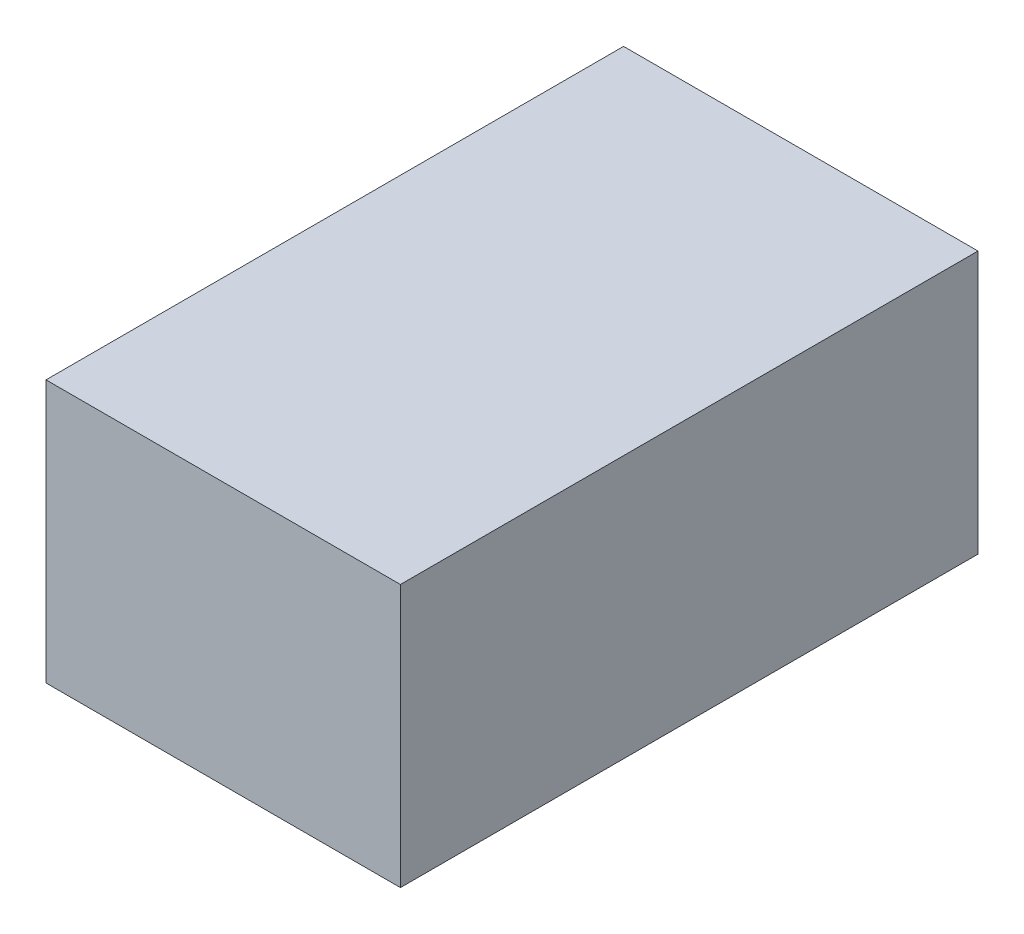
ISO-10303-21;
HEADER;
FILE_DESCRIPTION(('STEP AP214'),'2;1');
FILE_NAME('part.step','',(''),(''),'','','');
FILE_SCHEMA(('AUTOMOTIVE_DESIGN { 1 0 10303 214 1 1 1 1 }'));
ENDSEC;
DATA;
#1=APPLICATION_CONTEXT('core data for automotive mechanical design processes');
#2=APPLICATION_PROTOCOL_DEFINITION('international standard','automotive_design',2000,#1);
#3=PRODUCT_CONTEXT('',#1,'mechanical');
#4=PRODUCT('Part','Part','',(#3));
#5=PRODUCT_RELATED_PRODUCT_CATEGORY('part','',(#4));
#6=PRODUCT_DEFINITION_FORMATION('','',#4);
#7=PRODUCT_DEFINITION_CONTEXT('part definition',#1,'design');
#8=PRODUCT_DEFINITION('design','',#6,#7);
#9=PRODUCT_DEFINITION_SHAPE('','',#8);
#10=(LENGTH_UNIT() NAMED_UNIT(*) SI_UNIT(.MILLI.,.METRE.));
#11=(NAMED_UNIT(*) PLANE_ANGLE_UNIT() SI_UNIT($,.RADIAN.));
#12=(NAMED_UNIT(*) SI_UNIT($,.STERADIAN.) SOLID_ANGLE_UNIT());
#13=UNCERTAINTY_MEASURE_WITH_UNIT(LENGTH_MEASURE(1.E-05),#10,'distance_accuracy_value','');
#14=(GEOMETRIC_REPRESENTATION_CONTEXT(3) GLOBAL_UNCERTAINTY_ASSIGNED_CONTEXT((#13)) GLOBAL_UNIT_ASSIGNED_CONTEXT((#10,
#11,#12)) REPRESENTATION_CONTEXT('',''));
#15=CARTESIAN_POINT('',(0.,0.,0.));
#16=DIRECTION('',(0.,0.,1.));
#17=DIRECTION('',(1.,0.,0.));
#18=AXIS2_PLACEMENT_3D('',#15,#16,#17);
#19=CARTESIAN_POINT('',(25.175,-0.85,-47.2));
#20=DIRECTION('',(0.,1.,0.));
#21=DIRECTION('',(0.,0.,-1.));
#22=AXIS2_PLACEMENT_3D('',#19,#20,#21);
#23=PLANE('',#22);
#24=DIRECTION('',(1.,0.,0.));
#25=VECTOR('',#24,1.);
#26=CARTESIAN_POINT('',(23.825,-0.85,-51.6));
#27=LINE('',#26,#25);
#28=CARTESIAN_POINT('',(22.475,-0.85,-51.6));
#29=VERTEX_POINT('',#28);
#30=CARTESIAN_POINT('',(25.175,-0.85,-51.6));
#31=VERTEX_POINT('',#30);
#32=EDGE_CURVE('E54',#29,#31,#27,.T.);
#33=ORIENTED_EDGE('',*,*,#32,.F.);
#34=DIRECTION('',(0.,0.,-1.));
#35=VECTOR('',#34,1.);
#36=CARTESIAN_POINT('',(22.475,-0.85,-49.4));
#37=LINE('',#36,#35);
#38=CARTESIAN_POINT('',(22.475,-0.85,-47.2));
#39=VERTEX_POINT('',#38);
#40=EDGE_CURVE('E69',#39,#29,#37,.T.);
#41=ORIENTED_EDGE('',*,*,#40,.F.);
#42=DIRECTION('',(-1.,0.,0.));
#43=VECTOR('',#42,1.);
#44=CARTESIAN_POINT('',(23.825,-0.85,-47.2));
#45=LINE('',#44,#43);
#46=CARTESIAN_POINT('',(25.175,-0.85,-47.2));
#47=VERTEX_POINT('',#46);
#48=EDGE_CURVE('E21',#47,#39,#45,.T.);
#49=ORIENTED_EDGE('',*,*,#48,.F.);
#50=DIRECTION('',(0.,0.,1.));
#51=VECTOR('',#50,1.);
#52=CARTESIAN_POINT('',(25.175,-0.85,-49.4));
#53=LINE('',#52,#51);
#54=EDGE_CURVE('E59',#31,#47,#53,.T.);
#55=ORIENTED_EDGE('',*,*,#54,.F.);
#56=EDGE_LOOP('',(#33,#41,#49,#55));
#57=FACE_BOUND('',#56,.T.);
#58=ADVANCED_FACE('F17',(#57),#23,.T.);
#59=CARTESIAN_POINT('',(22.475,-2.85,-47.2));
#60=DIRECTION('',(0.,0.,1.));
#61=DIRECTION('',(1.,0.,0.));
#62=AXIS2_PLACEMENT_3D('',#59,#60,#61);
#63=PLANE('',#62);
#64=ORIENTED_EDGE('',*,*,#48,.T.);
#65=DIRECTION('',(0.,1.,0.));
#66=VECTOR('',#65,1.);
#67=CARTESIAN_POINT('',(22.475,-1.85,-47.2));
#68=LINE('',#67,#66);
#69=CARTESIAN_POINT('',(22.475,-2.85,-47.2));
#70=VERTEX_POINT('',#69);
#71=EDGE_CURVE('E80',#70,#39,#68,.T.);
#72=ORIENTED_EDGE('',*,*,#71,.F.);
#73=DIRECTION('',(1.,0.,0.));
#74=VECTOR('',#73,1.);
#75=CARTESIAN_POINT('',(23.825,-2.85,-47.2));
#76=LINE('',#75,#74);
#77=CARTESIAN_POINT('',(25.175,-2.85,-47.2));
#78=VERTEX_POINT('',#77);
#79=EDGE_CURVE('E75',#70,#78,#76,.T.);
#80=ORIENTED_EDGE('',*,*,#79,.T.);
#81=DIRECTION('',(0.,-1.,0.));
#82=VECTOR('',#81,1.);
#83=CARTESIAN_POINT('',(25.175,-1.85,-47.2));
#84=LINE('',#83,#82);
#85=EDGE_CURVE('E64',#47,#78,#84,.T.);
#86=ORIENTED_EDGE('',*,*,#85,.F.);
#87=EDGE_LOOP('',(#64,#72,#80,#86));
#88=FACE_BOUND('',#87,.T.);
#89=ADVANCED_FACE('F74',(#88),#63,.T.);
#90=CARTESIAN_POINT('',(25.175,-2.85,-47.2));
#91=DIRECTION('',(1.,0.,0.));
#92=DIRECTION('',(0.,0.,-1.));
#93=AXIS2_PLACEMENT_3D('',#90,#91,#92);
#94=PLANE('',#93);
#95=ORIENTED_EDGE('',*,*,#54,.T.);
#96=ORIENTED_EDGE('',*,*,#85,.T.);
#97=DIRECTION('',(0.,0.,-1.));
#98=VECTOR('',#97,1.);
#99=CARTESIAN_POINT('',(25.175,-2.85,-49.4));
#100=LINE('',#99,#98);
#101=CARTESIAN_POINT('',(25.175,-2.85,-51.6));
#102=VERTEX_POINT('',#101);
#103=EDGE_CURVE('E85',#78,#102,#100,.T.);
#104=ORIENTED_EDGE('',*,*,#103,.T.);
#105=DIRECTION('',(0.,-1.,0.));
#106=VECTOR('',#105,1.);
#107=CARTESIAN_POINT('',(25.175,-1.85,-51.6));
#108=LINE('',#107,#106);
#109=EDGE_CURVE('E66',#31,#102,#108,.T.);
#110=ORIENTED_EDGE('',*,*,#109,.F.);
#111=EDGE_LOOP('',(#95,#96,#104,#110));
#112=FACE_BOUND('',#111,.T.);
#113=ADVANCED_FACE('F61',(#112),#94,.T.);
#114=CARTESIAN_POINT('',(25.175,-2.85,-51.6));
#115=DIRECTION('',(0.,0.,-1.));
#116=DIRECTION('',(-1.,0.,0.));
#117=AXIS2_PLACEMENT_3D('',#114,#115,#116);
#118=PLANE('',#117);
#119=ORIENTED_EDGE('',*,*,#32,.T.);
#120=ORIENTED_EDGE('',*,*,#109,.T.);
#121=DIRECTION('',(-1.,0.,0.));
#122=VECTOR('',#121,1.);
#123=CARTESIAN_POINT('',(23.825,-2.85,-51.6));
#124=LINE('',#123,#122);
#125=CARTESIAN_POINT('',(22.475,-2.85,-51.6));
#126=VERTEX_POINT('',#125);
#127=EDGE_CURVE('E27',#102,#126,#124,.T.);
#128=ORIENTED_EDGE('',*,*,#127,.T.);
#129=DIRECTION('',(0.,-1.,0.));
#130=VECTOR('',#129,1.);
#131=CARTESIAN_POINT('',(22.475,-1.85,-51.6));
#132=LINE('',#131,#130);
#133=EDGE_CURVE('E35',#29,#126,#132,.T.);
#134=ORIENTED_EDGE('',*,*,#133,.F.);
#135=EDGE_LOOP('',(#119,#120,#128,#134));
#136=FACE_BOUND('',#135,.T.);
#137=ADVANCED_FACE('F89',(#136),#118,.T.);
#138=CARTESIAN_POINT('',(22.475,-2.85,-51.6));
#139=DIRECTION('',(-1.,0.,0.));
#140=DIRECTION('',(0.,0.,1.));
#141=AXIS2_PLACEMENT_3D('',#138,#139,#140);
#142=PLANE('',#141);
#143=ORIENTED_EDGE('',*,*,#40,.T.);
#144=ORIENTED_EDGE('',*,*,#133,.T.);
#145=DIRECTION('',(0.,0.,1.));
#146=VECTOR('',#145,1.);
#147=CARTESIAN_POINT('',(22.475,-2.85,-49.4));
#148=LINE('',#147,#146);
#149=EDGE_CURVE('E11',#126,#70,#148,.T.);
#150=ORIENTED_EDGE('',*,*,#149,.T.);
#151=ORIENTED_EDGE('',*,*,#71,.T.);
#152=EDGE_LOOP('',(#143,#144,#150,#151));
#153=FACE_BOUND('',#152,.T.);
#154=ADVANCED_FACE('F91',(#153),#142,.T.);
#155=CARTESIAN_POINT('',(25.175,-2.85,-47.2));
#156=DIRECTION('',(0.,1.,0.));
#157=DIRECTION('',(0.,0.,-1.));
#158=AXIS2_PLACEMENT_3D('',#155,#156,#157);
#159=PLANE('',#158);
#160=ORIENTED_EDGE('',*,*,#127,.F.);
#161=ORIENTED_EDGE('',*,*,#103,.F.);
#162=ORIENTED_EDGE('',*,*,#79,.F.);
#163=ORIENTED_EDGE('',*,*,#149,.F.);
#164=EDGE_LOOP('',(#160,#161,#162,#163));
#165=FACE_BOUND('',#164,.T.);
#166=ADVANCED_FACE('F19',(#165),#159,.F.);
#167=CLOSED_SHELL('',(#58,#89,#113,#137,#154,#166));
#168=MANIFOLD_SOLID_BREP('B1',#167);
#169=ADVANCED_BREP_SHAPE_REPRESENTATION('',(#18,#168),#14);
#170=SHAPE_DEFINITION_REPRESENTATION(#9,#169);
ENDSEC;
END-ISO-10303-21;
